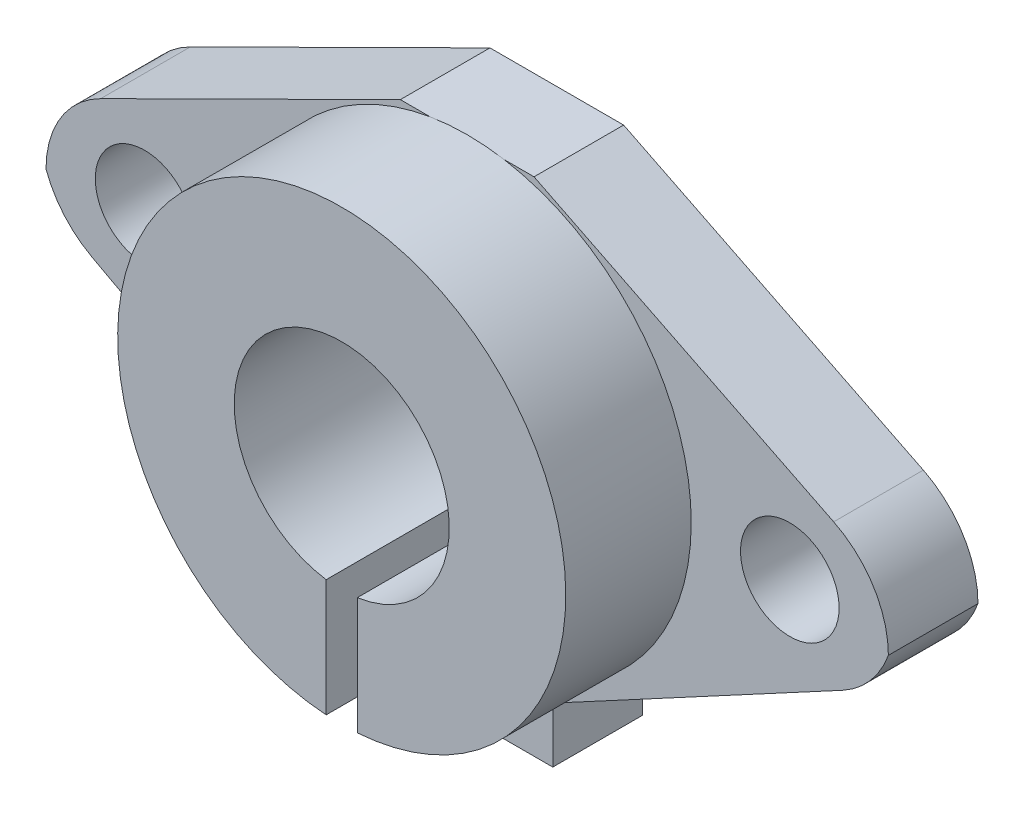
ISO-10303-21;
HEADER;
FILE_DESCRIPTION(('STEP AP214'),'2;1');
FILE_NAME('part.step','',(''),(''),'','','');
FILE_SCHEMA(('AUTOMOTIVE_DESIGN { 1 0 10303 214 1 1 1 1 }'));
ENDSEC;
DATA;
#1=APPLICATION_CONTEXT('core data for automotive mechanical design processes');
#2=APPLICATION_PROTOCOL_DEFINITION('international standard','automotive_design',2000,#1);
#3=PRODUCT_CONTEXT('',#1,'mechanical');
#4=PRODUCT('Part','Part','',(#3));
#5=PRODUCT_RELATED_PRODUCT_CATEGORY('part','',(#4));
#6=PRODUCT_DEFINITION_FORMATION('','',#4);
#7=PRODUCT_DEFINITION_CONTEXT('part definition',#1,'design');
#8=PRODUCT_DEFINITION('design','',#6,#7);
#9=PRODUCT_DEFINITION_SHAPE('','',#8);
#10=(LENGTH_UNIT() NAMED_UNIT(*) SI_UNIT(.MILLI.,.METRE.));
#11=(NAMED_UNIT(*) PLANE_ANGLE_UNIT() SI_UNIT($,.RADIAN.));
#12=(NAMED_UNIT(*) SI_UNIT($,.STERADIAN.) SOLID_ANGLE_UNIT());
#13=UNCERTAINTY_MEASURE_WITH_UNIT(LENGTH_MEASURE(1.E-05),#10,'distance_accuracy_value','');
#14=(GEOMETRIC_REPRESENTATION_CONTEXT(3) GLOBAL_UNCERTAINTY_ASSIGNED_CONTEXT((#13)) GLOBAL_UNIT_ASSIGNED_CONTEXT((#10,
#11,#12)) REPRESENTATION_CONTEXT('',''));
#15=CARTESIAN_POINT('',(0.,0.,0.));
#16=DIRECTION('',(0.,0.,1.));
#17=DIRECTION('',(1.,0.,0.));
#18=AXIS2_PLACEMENT_3D('',#15,#16,#17);
#19=CARTESIAN_POINT('',(0.,0.,5.));
#20=DIRECTION('',(0.,0.,1.));
#21=DIRECTION('',(1.,0.,0.));
#22=AXIS2_PLACEMENT_3D('',#19,#20,#21);
#23=PLANE('',#22);
#24=CARTESIAN_POINT('',(-18.,0.,5.));
#25=DIRECTION('',(0.,0.,1.));
#26=DIRECTION('',(1.,0.,0.));
#27=AXIS2_PLACEMENT_3D('',#24,#25,#26);
#28=CIRCLE('',#27,2.75);
#29=CARTESIAN_POINT('',(-15.25,0.,5.));
#30=VERTEX_POINT('',#29);
#31=EDGE_CURVE('E377',#30,#30,#28,.T.);
#32=ORIENTED_EDGE('',*,*,#31,.F.);
#33=EDGE_LOOP('',(#32));
#34=FACE_BOUND('',#33,.T.);
#35=CARTESIAN_POINT('',(-18.,-0.907891049391296,5.));
#36=DIRECTION('',(0.,0.,1.));
#37=DIRECTION('',(1.,0.,0.));
#38=AXIS2_PLACEMENT_3D('',#35,#36,#37);
#39=CIRCLE('',#38,5.5);
#40=CARTESIAN_POINT('',(-20.4484094780944,4.01707504466231,5.));
#41=VERTEX_POINT('',#40);
#42=CARTESIAN_POINT('',(-23.5,-0.907891049391296,5.));
#43=VERTEX_POINT('',#42);
#44=EDGE_CURVE('E281',#41,#43,#39,.T.);
#45=ORIENTED_EDGE('',*,*,#44,.T.);
#46=CARTESIAN_POINT('',(-18.3276639936402,0.96211970921791,5.));
#47=DIRECTION('',(0.,0.,1.));
#48=DIRECTION('',(1.,0.,0.));
#49=AXIS2_PLACEMENT_3D('',#46,#47,#48);
#50=CIRCLE('',#49,5.5);
#51=CARTESIAN_POINT('',(-20.9343819383381,-3.88091875406011,5.));
#52=VERTEX_POINT('',#51);
#53=EDGE_CURVE('E288',#43,#52,#50,.T.);
#54=ORIENTED_EDGE('',*,*,#53,.T.);
#55=DIRECTION('',(0.880552447868731,-0.473948717217787,0.));
#56=VECTOR('',#55,1.);
#57=CARTESIAN_POINT('',(-23.5,-2.5,5.));
#58=LINE('',#57,#56);
#59=CARTESIAN_POINT('',(-4.77576716215987,-12.5781346481527,5.));
#60=VERTEX_POINT('',#59);
#61=EDGE_CURVE('E216',#52,#60,#58,.T.);
#62=ORIENTED_EDGE('',*,*,#61,.T.);
#63=DIRECTION('',(0.,-1.,0.));
#64=VECTOR('',#63,1.);
#65=CARTESIAN_POINT('',(-4.77576716215987,-12.5781346481527,5.));
#66=LINE('',#65,#64);
#67=CARTESIAN_POINT('',(-4.77576716215987,-15.6709566880416,5.));
#68=VERTEX_POINT('',#67);
#69=EDGE_CURVE('E218',#60,#68,#66,.T.);
#70=ORIENTED_EDGE('',*,*,#69,.T.);
#71=DIRECTION('',(1.,0.,0.));
#72=VECTOR('',#71,1.);
#73=CARTESIAN_POINT('',(-4.77576716215987,-15.6709566880416,5.));
#74=LINE('',#73,#72);
#75=CARTESIAN_POINT('',(-0.868489511999576,-15.6709566880416,5.));
#76=VERTEX_POINT('',#75);
#77=EDGE_CURVE('E220',#68,#76,#74,.T.);
#78=ORIENTED_EDGE('',*,*,#77,.T.);
#79=DIRECTION('',(0.,1.,0.));
#80=VECTOR('',#79,1.);
#81=CARTESIAN_POINT('',(-0.868489511999576,-15.6709566880416,5.));
#82=LINE('',#81,#80);
#83=CARTESIAN_POINT('',(-0.868489511999576,-12.469792539074,5.));
#84=VERTEX_POINT('',#83);
#85=EDGE_CURVE('E222',#76,#84,#82,.T.);
#86=ORIENTED_EDGE('',*,*,#85,.T.);
#87=CARTESIAN_POINT('',(0.,0.,5.));
#88=DIRECTION('',(0.,0.,1.));
#89=DIRECTION('',(1.,0.,0.));
#90=AXIS2_PLACEMENT_3D('',#87,#88,#89);
#91=CIRCLE('',#90,12.5);
#92=CARTESIAN_POINT('',(-2.06026479168432,12.3290433119584,5.));
#93=VERTEX_POINT('',#92);
#94=EDGE_CURVE('E199',#93,#84,#91,.T.);
#95=ORIENTED_EDGE('',*,*,#94,.F.);
#96=DIRECTION('',(-1.,0.,0.));
#97=VECTOR('',#96,1.);
#98=CARTESIAN_POINT('',(-3.72891780093276,12.3290433119584,5.));
#99=LINE('',#98,#97);
#100=CARTESIAN_POINT('',(-3.72891780093276,12.3290433119584,5.));
#101=VERTEX_POINT('',#100);
#102=EDGE_CURVE('E209',#93,#101,#99,.T.);
#103=ORIENTED_EDGE('',*,*,#102,.T.);
#104=DIRECTION('',(-0.895448380737018,-0.445165359653524,0.));
#105=VECTOR('',#104,1.);
#106=CARTESIAN_POINT('',(-3.72891780093276,12.3290433119584,5.));
#107=LINE('',#106,#105);
#108=EDGE_CURVE('E212',#101,#41,#107,.T.);
#109=ORIENTED_EDGE('',*,*,#108,.T.);
#110=EDGE_LOOP('',(#45,#54,#62,#70,#78,#86,#95,#103,#109));
#111=FACE_BOUND('',#110,.T.);
#112=ADVANCED_FACE('F36',(#34,#111),#23,.T.);
#113=CARTESIAN_POINT('',(23.5,-2.5,5.));
#114=DIRECTION('',(-0.473948717217787,0.880552447868731,0.));
#115=DIRECTION('',(-0.880552447868731,-0.473948717217787,0.));
#116=AXIS2_PLACEMENT_3D('',#113,#114,#115);
#117=PLANE('',#116);
#118=DIRECTION('',(0.880552447868731,0.473948717217787,0.));
#119=VECTOR('',#118,1.);
#120=CARTESIAN_POINT('',(23.5,-2.5,0.));
#121=LINE('',#120,#119);
#122=CARTESIAN_POINT('',(4.77576716215987,-12.5781346481527,0.));
#123=VERTEX_POINT('',#122);
#124=CARTESIAN_POINT('',(20.9343819383381,-3.88091875406011,0.));
#125=VERTEX_POINT('',#124);
#126=EDGE_CURVE('E191',#123,#125,#121,.T.);
#127=ORIENTED_EDGE('',*,*,#126,.T.);
#128=DIRECTION('',(0.,0.,-1.));
#129=VECTOR('',#128,1.);
#130=CARTESIAN_POINT('',(20.9343819383381,-3.88091875406011,5.));
#131=LINE('',#130,#129);
#132=CARTESIAN_POINT('',(20.9343819383381,-3.88091875406011,5.));
#133=VERTEX_POINT('',#132);
#134=EDGE_CURVE('E44',#125,#133,#131,.F.);
#135=ORIENTED_EDGE('',*,*,#134,.T.);
#136=DIRECTION('',(0.880552447868731,0.473948717217787,0.));
#137=VECTOR('',#136,1.);
#138=CARTESIAN_POINT('',(23.5,-2.5,5.));
#139=LINE('',#138,#137);
#140=CARTESIAN_POINT('',(4.77576716215987,-12.5781346481527,5.));
#141=VERTEX_POINT('',#140);
#142=EDGE_CURVE('E204',#141,#133,#139,.T.);
#143=ORIENTED_EDGE('',*,*,#142,.F.);
#144=DIRECTION('',(0.,0.,-1.));
#145=VECTOR('',#144,1.);
#146=CARTESIAN_POINT('',(4.77576716215987,-12.5781346481527,5.));
#147=LINE('',#146,#145);
#148=EDGE_CURVE('E229',#141,#123,#147,.T.);
#149=ORIENTED_EDGE('',*,*,#148,.T.);
#150=EDGE_LOOP('',(#127,#135,#143,#149));
#151=FACE_BOUND('',#150,.T.);
#152=ADVANCED_FACE('F309',(#151),#117,.F.);
#153=CARTESIAN_POINT('',(3.72891780093276,12.3290433119584,5.));
#154=DIRECTION('',(-0.445165359653524,-0.895448380737018,0.));
#155=DIRECTION('',(0.895448380737018,-0.445165359653524,0.));
#156=AXIS2_PLACEMENT_3D('',#153,#154,#155);
#157=PLANE('',#156);
#158=DIRECTION('',(-0.895448380737018,0.445165359653524,0.));
#159=VECTOR('',#158,1.);
#160=CARTESIAN_POINT('',(3.72891780093276,12.3290433119584,5.));
#161=LINE('',#160,#159);
#162=CARTESIAN_POINT('',(20.4484094780944,4.01707504466231,5.));
#163=VERTEX_POINT('',#162);
#164=CARTESIAN_POINT('',(3.72891780093276,12.3290433119584,5.));
#165=VERTEX_POINT('',#164);
#166=EDGE_CURVE('E206',#163,#165,#161,.T.);
#167=ORIENTED_EDGE('',*,*,#166,.F.);
#168=DIRECTION('',(0.,0.,-1.));
#169=VECTOR('',#168,1.);
#170=CARTESIAN_POINT('',(20.4484094780944,4.01707504466231,5.));
#171=LINE('',#170,#169);
#172=CARTESIAN_POINT('',(20.4484094780944,4.01707504466231,0.));
#173=VERTEX_POINT('',#172);
#174=EDGE_CURVE('E290',#163,#173,#171,.T.);
#175=ORIENTED_EDGE('',*,*,#174,.T.);
#176=DIRECTION('',(-0.895448380737018,0.445165359653524,0.));
#177=VECTOR('',#176,1.);
#178=CARTESIAN_POINT('',(3.72891780093276,12.3290433119584,0.));
#179=LINE('',#178,#177);
#180=CARTESIAN_POINT('',(3.72891780093276,12.3290433119584,0.));
#181=VERTEX_POINT('',#180);
#182=EDGE_CURVE('E194',#173,#181,#179,.T.);
#183=ORIENTED_EDGE('',*,*,#182,.T.);
#184=DIRECTION('',(0.,0.,-1.));
#185=VECTOR('',#184,1.);
#186=CARTESIAN_POINT('',(3.72891780093276,12.3290433119584,5.));
#187=LINE('',#186,#185);
#188=EDGE_CURVE('E271',#165,#181,#187,.T.);
#189=ORIENTED_EDGE('',*,*,#188,.F.);
#190=EDGE_LOOP('',(#167,#175,#183,#189));
#191=FACE_BOUND('',#190,.T.);
#192=ADVANCED_FACE('F320',(#191),#157,.F.);
#193=CARTESIAN_POINT('',(-3.72891780093276,12.3290433119584,5.));
#194=DIRECTION('',(0.,-1.,0.));
#195=DIRECTION('',(0.,0.,-1.));
#196=AXIS2_PLACEMENT_3D('',#193,#194,#195);
#197=PLANE('',#196);
#198=DIRECTION('',(-1.,0.,0.));
#199=VECTOR('',#198,1.);
#200=CARTESIAN_POINT('',(-3.72891780093276,12.3290433119584,0.));
#201=LINE('',#200,#199);
#202=CARTESIAN_POINT('',(-3.72891780093276,12.3290433119584,0.));
#203=VERTEX_POINT('',#202);
#204=EDGE_CURVE('E232',#181,#203,#201,.T.);
#205=ORIENTED_EDGE('',*,*,#204,.T.);
#206=DIRECTION('',(0.,0.,-1.));
#207=VECTOR('',#206,1.);
#208=CARTESIAN_POINT('',(-3.72891780093276,12.3290433119584,5.));
#209=LINE('',#208,#207);
#210=EDGE_CURVE('E268',#101,#203,#209,.T.);
#211=ORIENTED_EDGE('',*,*,#210,.F.);
#212=ORIENTED_EDGE('',*,*,#102,.F.);
#213=CARTESIAN_POINT('',(2.06026479168432,12.3290433119584,5.));
#214=VERTEX_POINT('',#213);
#215=EDGE_CURVE('E213',#214,#93,#99,.T.);
#216=ORIENTED_EDGE('',*,*,#215,.F.);
#217=EDGE_CURVE('E210',#165,#214,#99,.T.);
#218=ORIENTED_EDGE('',*,*,#217,.F.);
#219=ORIENTED_EDGE('',*,*,#188,.T.);
#220=EDGE_LOOP('',(#205,#211,#212,#216,#218,#219));
#221=FACE_BOUND('',#220,.T.);
#222=ADVANCED_FACE('F326',(#221),#197,.F.);
#223=CARTESIAN_POINT('',(-3.72891780093276,12.3290433119584,5.));
#224=DIRECTION('',(0.445165359653524,-0.895448380737018,0.));
#225=DIRECTION('',(0.895448380737018,0.445165359653524,0.));
#226=AXIS2_PLACEMENT_3D('',#223,#224,#225);
#227=PLANE('',#226);
#228=DIRECTION('',(-0.895448380737018,-0.445165359653524,0.));
#229=VECTOR('',#228,1.);
#230=CARTESIAN_POINT('',(-3.72891780093276,12.3290433119584,0.));
#231=LINE('',#230,#229);
#232=CARTESIAN_POINT('',(-20.4484094780944,4.01707504466231,0.));
#233=VERTEX_POINT('',#232);
#234=EDGE_CURVE('E234',#203,#233,#231,.T.);
#235=ORIENTED_EDGE('',*,*,#234,.T.);
#236=DIRECTION('',(0.,0.,-1.));
#237=VECTOR('',#236,1.);
#238=CARTESIAN_POINT('',(-20.4484094780944,4.01707504466231,5.));
#239=LINE('',#238,#237);
#240=EDGE_CURVE('E279',#233,#41,#239,.F.);
#241=ORIENTED_EDGE('',*,*,#240,.T.);
#242=ORIENTED_EDGE('',*,*,#108,.F.);
#243=ORIENTED_EDGE('',*,*,#210,.T.);
#244=EDGE_LOOP('',(#235,#241,#242,#243));
#245=FACE_BOUND('',#244,.T.);
#246=ADVANCED_FACE('F331',(#245),#227,.F.);
#247=CARTESIAN_POINT('',(-23.5,-2.5,5.));
#248=DIRECTION('',(0.473948717217787,0.880552447868731,0.));
#249=DIRECTION('',(-0.880552447868731,0.473948717217787,0.));
#250=AXIS2_PLACEMENT_3D('',#247,#248,#249);
#251=PLANE('',#250);
#252=ORIENTED_EDGE('',*,*,#61,.F.);
#253=DIRECTION('',(0.,0.,-1.));
#254=VECTOR('',#253,1.);
#255=CARTESIAN_POINT('',(-20.9343819383381,-3.88091875406011,5.));
#256=LINE('',#255,#254);
#257=CARTESIAN_POINT('',(-20.9343819383381,-3.88091875406011,0.));
#258=VERTEX_POINT('',#257);
#259=EDGE_CURVE('E283',#52,#258,#256,.T.);
#260=ORIENTED_EDGE('',*,*,#259,.T.);
#261=DIRECTION('',(0.880552447868731,-0.473948717217787,0.));
#262=VECTOR('',#261,1.);
#263=CARTESIAN_POINT('',(-23.5,-2.5,0.));
#264=LINE('',#263,#262);
#265=CARTESIAN_POINT('',(-4.77576716215987,-12.5781346481527,0.));
#266=VERTEX_POINT('',#265);
#267=EDGE_CURVE('E237',#258,#266,#264,.T.);
#268=ORIENTED_EDGE('',*,*,#267,.T.);
#269=DIRECTION('',(0.,0.,-1.));
#270=VECTOR('',#269,1.);
#271=CARTESIAN_POINT('',(-4.77576716215987,-12.5781346481527,5.));
#272=LINE('',#271,#270);
#273=EDGE_CURVE('E265',#60,#266,#272,.T.);
#274=ORIENTED_EDGE('',*,*,#273,.F.);
#275=EDGE_LOOP('',(#252,#260,#268,#274));
#276=FACE_BOUND('',#275,.T.);
#277=ADVANCED_FACE('F346',(#276),#251,.F.);
#278=CARTESIAN_POINT('',(-4.77576716215987,-12.5781346481527,5.));
#279=DIRECTION('',(1.,0.,0.));
#280=DIRECTION('',(0.,0.,-1.));
#281=AXIS2_PLACEMENT_3D('',#278,#279,#280);
#282=PLANE('',#281);
#283=DIRECTION('',(0.,-1.,0.));
#284=VECTOR('',#283,1.);
#285=CARTESIAN_POINT('',(-4.77576716215987,-12.5781346481527,0.));
#286=LINE('',#285,#284);
#287=CARTESIAN_POINT('',(-4.77576716215987,-15.6709566880416,0.));
#288=VERTEX_POINT('',#287);
#289=EDGE_CURVE('E239',#266,#288,#286,.T.);
#290=ORIENTED_EDGE('',*,*,#289,.T.);
#291=DIRECTION('',(0.,0.,-1.));
#292=VECTOR('',#291,1.);
#293=CARTESIAN_POINT('',(-4.77576716215987,-15.6709566880416,5.));
#294=LINE('',#293,#292);
#295=EDGE_CURVE('E262',#68,#288,#294,.T.);
#296=ORIENTED_EDGE('',*,*,#295,.F.);
#297=ORIENTED_EDGE('',*,*,#69,.F.);
#298=ORIENTED_EDGE('',*,*,#273,.T.);
#299=EDGE_LOOP('',(#290,#296,#297,#298));
#300=FACE_BOUND('',#299,.T.);
#301=ADVANCED_FACE('F352',(#300),#282,.F.);
#302=CARTESIAN_POINT('',(-4.77576716215987,-15.6709566880416,5.));
#303=DIRECTION('',(0.,1.,0.));
#304=DIRECTION('',(0.,0.,1.));
#305=AXIS2_PLACEMENT_3D('',#302,#303,#304);
#306=PLANE('',#305);
#307=DIRECTION('',(1.,0.,0.));
#308=VECTOR('',#307,1.);
#309=CARTESIAN_POINT('',(-4.77576716215987,-15.6709566880416,0.));
#310=LINE('',#309,#308);
#311=CARTESIAN_POINT('',(-0.868489511999576,-15.6709566880416,0.));
#312=VERTEX_POINT('',#311);
#313=EDGE_CURVE('E241',#288,#312,#310,.T.);
#314=ORIENTED_EDGE('',*,*,#313,.T.);
#315=DIRECTION('',(0.,0.,-1.));
#316=VECTOR('',#315,1.);
#317=CARTESIAN_POINT('',(-0.868489511999576,-15.6709566880416,5.));
#318=LINE('',#317,#316);
#319=EDGE_CURVE('E259',#76,#312,#318,.T.);
#320=ORIENTED_EDGE('',*,*,#319,.F.);
#321=ORIENTED_EDGE('',*,*,#77,.F.);
#322=ORIENTED_EDGE('',*,*,#295,.T.);
#323=EDGE_LOOP('',(#314,#320,#321,#322));
#324=FACE_BOUND('',#323,.T.);
#325=ADVANCED_FACE('F357',(#324),#306,.F.);
#326=CARTESIAN_POINT('',(-0.868489511999576,-15.6709566880416,5.));
#327=DIRECTION('',(-1.,0.,0.));
#328=DIRECTION('',(0.,0.,1.));
#329=AXIS2_PLACEMENT_3D('',#326,#327,#328);
#330=PLANE('',#329);
#331=DIRECTION('',(0.,1.,0.));
#332=VECTOR('',#331,1.);
#333=CARTESIAN_POINT('',(-0.868489511999576,-15.6709566880416,0.));
#334=LINE('',#333,#332);
#335=CARTESIAN_POINT('',(-0.868489511999576,-5.93681109414362,0.));
#336=VERTEX_POINT('',#335);
#337=EDGE_CURVE('E243',#312,#336,#334,.T.);
#338=ORIENTED_EDGE('',*,*,#337,.T.);
#339=DIRECTION('',(0.,0.,1.));
#340=VECTOR('',#339,1.);
#341=CARTESIAN_POINT('',(-0.868489511999576,-5.93681109414362,0.));
#342=LINE('',#341,#340);
#343=CARTESIAN_POINT('',(-0.868489511999576,-5.93681109414362,12.));
#344=VERTEX_POINT('',#343);
#345=EDGE_CURVE('E376',#336,#344,#342,.T.);
#346=ORIENTED_EDGE('',*,*,#345,.T.);
#347=DIRECTION('',(0.,-1.,0.));
#348=VECTOR('',#347,1.);
#349=CARTESIAN_POINT('',(-0.868489511999576,0.,12.));
#350=LINE('',#349,#348);
#351=CARTESIAN_POINT('',(-0.868489511999576,-12.469792539074,12.));
#352=VERTEX_POINT('',#351);
#353=EDGE_CURVE('E178',#344,#352,#350,.T.);
#354=ORIENTED_EDGE('',*,*,#353,.T.);
#355=DIRECTION('',(0.,0.,-1.));
#356=VECTOR('',#355,1.);
#357=CARTESIAN_POINT('',(-0.868489511999576,-12.469792539074,12.));
#358=LINE('',#357,#356);
#359=EDGE_CURVE('E190',#84,#352,#358,.F.);
#360=ORIENTED_EDGE('',*,*,#359,.F.);
#361=ORIENTED_EDGE('',*,*,#85,.F.);
#362=ORIENTED_EDGE('',*,*,#319,.T.);
#363=EDGE_LOOP('',(#338,#346,#354,#360,#361,#362));
#364=FACE_BOUND('',#363,.T.);
#365=ADVANCED_FACE('F361',(#364),#330,.F.);
#366=CARTESIAN_POINT('',(0.868489511999576,-15.6709566880416,5.));
#367=DIRECTION('',(1.,0.,0.));
#368=DIRECTION('',(0.,0.,-1.));
#369=AXIS2_PLACEMENT_3D('',#366,#367,#368);
#370=PLANE('',#369);
#371=DIRECTION('',(0.,-1.,0.));
#372=VECTOR('',#371,1.);
#373=CARTESIAN_POINT('',(0.868489511999576,-15.6709566880416,5.));
#374=LINE('',#373,#372);
#375=CARTESIAN_POINT('',(0.868489511999576,-12.469792539074,5.));
#376=VERTEX_POINT('',#375);
#377=CARTESIAN_POINT('',(0.868489511999576,-15.6709566880416,5.));
#378=VERTEX_POINT('',#377);
#379=EDGE_CURVE('E173',#376,#378,#374,.T.);
#380=ORIENTED_EDGE('',*,*,#379,.F.);
#381=DIRECTION('',(0.,0.,-1.));
#382=VECTOR('',#381,1.);
#383=CARTESIAN_POINT('',(0.868489511999576,-12.469792539074,12.));
#384=LINE('',#383,#382);
#385=CARTESIAN_POINT('',(0.868489511999576,-12.469792539074,12.));
#386=VERTEX_POINT('',#385);
#387=EDGE_CURVE('E167',#386,#376,#384,.T.);
#388=ORIENTED_EDGE('',*,*,#387,.F.);
#389=DIRECTION('',(0.,1.,0.));
#390=VECTOR('',#389,1.);
#391=CARTESIAN_POINT('',(0.868489511999576,0.,12.));
#392=LINE('',#391,#390);
#393=CARTESIAN_POINT('',(0.868489511999576,-5.93681109414362,12.));
#394=VERTEX_POINT('',#393);
#395=EDGE_CURVE('E170',#386,#394,#392,.T.);
#396=ORIENTED_EDGE('',*,*,#395,.T.);
#397=DIRECTION('',(0.,0.,1.));
#398=VECTOR('',#397,1.);
#399=CARTESIAN_POINT('',(0.868489511999576,-5.93681109414362,0.));
#400=LINE('',#399,#398);
#401=CARTESIAN_POINT('',(0.868489511999576,-5.93681109414362,0.));
#402=VERTEX_POINT('',#401);
#403=EDGE_CURVE('E51',#394,#402,#400,.F.);
#404=ORIENTED_EDGE('',*,*,#403,.T.);
#405=DIRECTION('',(0.,-1.,0.));
#406=VECTOR('',#405,1.);
#407=CARTESIAN_POINT('',(0.868489511999576,-15.6709566880416,0.));
#408=LINE('',#407,#406);
#409=CARTESIAN_POINT('',(0.868489511999576,-15.6709566880416,0.));
#410=VERTEX_POINT('',#409);
#411=EDGE_CURVE('E246',#402,#410,#408,.T.);
#412=ORIENTED_EDGE('',*,*,#411,.T.);
#413=DIRECTION('',(0.,0.,-1.));
#414=VECTOR('',#413,1.);
#415=CARTESIAN_POINT('',(0.868489511999576,-15.6709566880416,5.));
#416=LINE('',#415,#414);
#417=EDGE_CURVE('E256',#378,#410,#416,.T.);
#418=ORIENTED_EDGE('',*,*,#417,.F.);
#419=EDGE_LOOP('',(#380,#388,#396,#404,#412,#418));
#420=FACE_BOUND('',#419,.T.);
#421=ADVANCED_FACE('F169',(#420),#370,.F.);
#422=CARTESIAN_POINT('',(0.868489511999576,-15.6709566880416,5.));
#423=DIRECTION('',(0.,1.,0.));
#424=DIRECTION('',(0.,0.,1.));
#425=AXIS2_PLACEMENT_3D('',#422,#423,#424);
#426=PLANE('',#425);
#427=DIRECTION('',(1.,0.,0.));
#428=VECTOR('',#427,1.);
#429=CARTESIAN_POINT('',(0.868489511999576,-15.6709566880416,0.));
#430=LINE('',#429,#428);
#431=CARTESIAN_POINT('',(4.77576716215987,-15.6709566880416,0.));
#432=VERTEX_POINT('',#431);
#433=EDGE_CURVE('E248',#410,#432,#430,.T.);
#434=ORIENTED_EDGE('',*,*,#433,.T.);
#435=DIRECTION('',(0.,0.,-1.));
#436=VECTOR('',#435,1.);
#437=CARTESIAN_POINT('',(4.77576716215987,-15.6709566880416,5.));
#438=LINE('',#437,#436);
#439=CARTESIAN_POINT('',(4.77576716215987,-15.6709566880416,5.));
#440=VERTEX_POINT('',#439);
#441=EDGE_CURVE('E253',#440,#432,#438,.T.);
#442=ORIENTED_EDGE('',*,*,#441,.F.);
#443=DIRECTION('',(1.,0.,0.));
#444=VECTOR('',#443,1.);
#445=CARTESIAN_POINT('',(0.868489511999576,-15.6709566880416,5.));
#446=LINE('',#445,#444);
#447=EDGE_CURVE('E226',#378,#440,#446,.T.);
#448=ORIENTED_EDGE('',*,*,#447,.F.);
#449=ORIENTED_EDGE('',*,*,#417,.T.);
#450=EDGE_LOOP('',(#434,#442,#448,#449));
#451=FACE_BOUND('',#450,.T.);
#452=ADVANCED_FACE('F397',(#451),#426,.F.);
#453=CARTESIAN_POINT('',(4.77576716215987,-12.5781346481527,5.));
#454=DIRECTION('',(-1.,0.,0.));
#455=DIRECTION('',(0.,0.,1.));
#456=AXIS2_PLACEMENT_3D('',#453,#454,#455);
#457=PLANE('',#456);
#458=DIRECTION('',(0.,1.,0.));
#459=VECTOR('',#458,1.);
#460=CARTESIAN_POINT('',(4.77576716215987,-12.5781346481527,0.));
#461=LINE('',#460,#459);
#462=EDGE_CURVE('E207',#432,#123,#461,.T.);
#463=ORIENTED_EDGE('',*,*,#462,.T.);
#464=ORIENTED_EDGE('',*,*,#148,.F.);
#465=DIRECTION('',(0.,1.,0.));
#466=VECTOR('',#465,1.);
#467=CARTESIAN_POINT('',(4.77576716215987,-12.5781346481527,5.));
#468=LINE('',#467,#466);
#469=EDGE_CURVE('E228',#440,#141,#468,.T.);
#470=ORIENTED_EDGE('',*,*,#469,.F.);
#471=ORIENTED_EDGE('',*,*,#441,.T.);
#472=EDGE_LOOP('',(#463,#464,#470,#471));
#473=FACE_BOUND('',#472,.T.);
#474=ADVANCED_FACE('F388',(#473),#457,.F.);
#475=CARTESIAN_POINT('',(18.,0.,5.));
#476=DIRECTION('',(0.,0.,1.));
#477=DIRECTION('',(1.,0.,0.));
#478=AXIS2_PLACEMENT_3D('',#475,#476,#477);
#479=CIRCLE('',#478,2.75);
#480=CARTESIAN_POINT('',(20.75,0.,5.));
#481=VERTEX_POINT('',#480);
#482=EDGE_CURVE('E197',#481,#481,#479,.T.);
#483=ORIENTED_EDGE('',*,*,#482,.F.);
#484=EDGE_LOOP('',(#483));
#485=FACE_BOUND('',#484,.T.);
#486=ORIENTED_EDGE('',*,*,#142,.T.);
#487=CARTESIAN_POINT('',(18.3276639936402,0.96211970921791,5.));
#488=DIRECTION('',(0.,0.,1.));
#489=DIRECTION('',(1.,0.,0.));
#490=AXIS2_PLACEMENT_3D('',#487,#488,#489);
#491=CIRCLE('',#490,5.5);
#492=CARTESIAN_POINT('',(23.5,-0.907891049391296,5.));
#493=VERTEX_POINT('',#492);
#494=EDGE_CURVE('E11',#133,#493,#491,.T.);
#495=ORIENTED_EDGE('',*,*,#494,.T.);
#496=CARTESIAN_POINT('',(18.,-0.907891049391296,5.));
#497=DIRECTION('',(0.,0.,1.));
#498=DIRECTION('',(1.,0.,0.));
#499=AXIS2_PLACEMENT_3D('',#496,#497,#498);
#500=CIRCLE('',#499,5.5);
#501=EDGE_CURVE('E299',#493,#163,#500,.T.);
#502=ORIENTED_EDGE('',*,*,#501,.T.);
#503=ORIENTED_EDGE('',*,*,#166,.T.);
#504=ORIENTED_EDGE('',*,*,#217,.T.);
#505=EDGE_CURVE('E200',#376,#214,#91,.T.);
#506=ORIENTED_EDGE('',*,*,#505,.F.);
#507=ORIENTED_EDGE('',*,*,#379,.T.);
#508=ORIENTED_EDGE('',*,*,#447,.T.);
#509=ORIENTED_EDGE('',*,*,#469,.T.);
#510=EDGE_LOOP('',(#486,#495,#502,#503,#504,#506,#507,#508,#509));
#511=FACE_BOUND('',#510,.T.);
#512=ADVANCED_FACE('F314',(#485,#511),#23,.T.);
#513=CARTESIAN_POINT('',(0.,0.,0.));
#514=DIRECTION('',(0.,0.,1.));
#515=DIRECTION('',(1.,0.,0.));
#516=AXIS2_PLACEMENT_3D('',#513,#514,#515);
#517=PLANE('',#516);
#518=CARTESIAN_POINT('',(18.,0.,0.));
#519=DIRECTION('',(0.,0.,1.));
#520=DIRECTION('',(-1.,0.,0.));
#521=AXIS2_PLACEMENT_3D('',#518,#519,#520);
#522=CIRCLE('',#521,2.75);
#523=CARTESIAN_POINT('',(15.25,0.,0.));
#524=VERTEX_POINT('',#523);
#525=EDGE_CURVE('E362',#524,#524,#522,.T.);
#526=ORIENTED_EDGE('',*,*,#525,.T.);
#527=EDGE_LOOP('',(#526));
#528=FACE_BOUND('',#527,.T.);
#529=CARTESIAN_POINT('',(-18.,0.,0.));
#530=DIRECTION('',(0.,0.,1.));
#531=DIRECTION('',(1.,0.,0.));
#532=AXIS2_PLACEMENT_3D('',#529,#530,#531);
#533=CIRCLE('',#532,2.75);
#534=CARTESIAN_POINT('',(-15.25,0.,0.));
#535=VERTEX_POINT('',#534);
#536=EDGE_CURVE('E365',#535,#535,#533,.T.);
#537=ORIENTED_EDGE('',*,*,#536,.T.);
#538=EDGE_LOOP('',(#537));
#539=FACE_BOUND('',#538,.T.);
#540=CARTESIAN_POINT('',(18.,-0.907891049391296,0.));
#541=DIRECTION('',(0.,0.,1.));
#542=DIRECTION('',(1.,0.,0.));
#543=AXIS2_PLACEMENT_3D('',#540,#541,#542);
#544=CIRCLE('',#543,5.5);
#545=CARTESIAN_POINT('',(23.5,-0.907891049391296,0.));
#546=VERTEX_POINT('',#545);
#547=EDGE_CURVE('E293',#173,#546,#544,.F.);
#548=ORIENTED_EDGE('',*,*,#547,.T.);
#549=CARTESIAN_POINT('',(18.3276639936402,0.96211970921791,0.));
#550=DIRECTION('',(0.,0.,1.));
#551=DIRECTION('',(1.,0.,0.));
#552=AXIS2_PLACEMENT_3D('',#549,#550,#551);
#553=CIRCLE('',#552,5.5);
#554=EDGE_CURVE('E301',#546,#125,#553,.F.);
#555=ORIENTED_EDGE('',*,*,#554,.T.);
#556=ORIENTED_EDGE('',*,*,#126,.F.);
#557=ORIENTED_EDGE('',*,*,#462,.F.);
#558=ORIENTED_EDGE('',*,*,#433,.F.);
#559=ORIENTED_EDGE('',*,*,#411,.F.);
#560=CARTESIAN_POINT('',(0.,0.,0.));
#561=DIRECTION('',(0.,0.,1.));
#562=DIRECTION('',(1.,0.,0.));
#563=AXIS2_PLACEMENT_3D('',#560,#561,#562);
#564=CIRCLE('',#563,6.);
#565=EDGE_CURVE('E372',#402,#336,#564,.T.);
#566=ORIENTED_EDGE('',*,*,#565,.T.);
#567=ORIENTED_EDGE('',*,*,#337,.F.);
#568=ORIENTED_EDGE('',*,*,#313,.F.);
#569=ORIENTED_EDGE('',*,*,#289,.F.);
#570=ORIENTED_EDGE('',*,*,#267,.F.);
#571=CARTESIAN_POINT('',(-18.3276639936402,0.96211970921791,0.));
#572=DIRECTION('',(0.,0.,1.));
#573=DIRECTION('',(1.,0.,0.));
#574=AXIS2_PLACEMENT_3D('',#571,#572,#573);
#575=CIRCLE('',#574,5.5);
#576=CARTESIAN_POINT('',(-23.5,-0.907891049391296,0.));
#577=VERTEX_POINT('',#576);
#578=EDGE_CURVE('E286',#258,#577,#575,.F.);
#579=ORIENTED_EDGE('',*,*,#578,.T.);
#580=CARTESIAN_POINT('',(-18.,-0.907891049391296,0.));
#581=DIRECTION('',(0.,0.,1.));
#582=DIRECTION('',(1.,0.,0.));
#583=AXIS2_PLACEMENT_3D('',#580,#581,#582);
#584=CIRCLE('',#583,5.5);
#585=EDGE_CURVE('E277',#577,#233,#584,.F.);
#586=ORIENTED_EDGE('',*,*,#585,.T.);
#587=ORIENTED_EDGE('',*,*,#234,.F.);
#588=ORIENTED_EDGE('',*,*,#204,.F.);
#589=ORIENTED_EDGE('',*,*,#182,.F.);
#590=EDGE_LOOP('',(#548,#555,#556,#557,#558,#559,#566,#567,#568,#569,#570,#579,#586,#587,#588,#589));
#591=FACE_BOUND('',#590,.T.);
#592=ADVANCED_FACE('F304',(#528,#539,#591),#517,.F.);
#593=CARTESIAN_POINT('',(0.,0.,5.));
#594=DIRECTION('',(0.,0.,1.));
#595=DIRECTION('',(1.,0.,0.));
#596=AXIS2_PLACEMENT_3D('',#593,#594,#595);
#597=PLANE('',#596);
#598=EDGE_CURVE('E192',#214,#93,#91,.T.);
#599=ORIENTED_EDGE('',*,*,#598,.F.);
#600=ORIENTED_EDGE('',*,*,#215,.T.);
#601=EDGE_LOOP('',(#599,#600));
#602=FACE_BOUND('',#601,.T.);
#603=ADVANCED_FACE('F394',(#602),#597,.F.);
#604=CARTESIAN_POINT('',(0.,0.,12.));
#605=DIRECTION('',(0.,0.,-1.));
#606=DIRECTION('',(-1.,0.,0.));
#607=AXIS2_PLACEMENT_3D('',#604,#605,#606);
#608=CYLINDRICAL_SURFACE('',#607,12.5);
#609=ORIENTED_EDGE('',*,*,#94,.T.);
#610=ORIENTED_EDGE('',*,*,#359,.T.);
#611=CARTESIAN_POINT('',(0.,0.,12.));
#612=DIRECTION('',(0.,0.,1.));
#613=DIRECTION('',(1.,0.,0.));
#614=AXIS2_PLACEMENT_3D('',#611,#612,#613);
#615=CIRCLE('',#614,12.5);
#616=EDGE_CURVE('E184',#386,#352,#615,.T.);
#617=ORIENTED_EDGE('',*,*,#616,.F.);
#618=ORIENTED_EDGE('',*,*,#387,.T.);
#619=ORIENTED_EDGE('',*,*,#505,.T.);
#620=ORIENTED_EDGE('',*,*,#598,.T.);
#621=EDGE_LOOP('',(#609,#610,#617,#618,#619,#620));
#622=FACE_BOUND('',#621,.T.);
#623=ADVANCED_FACE('F189',(#622),#608,.T.);
#624=CARTESIAN_POINT('',(0.,0.,12.));
#625=DIRECTION('',(0.,0.,1.));
#626=DIRECTION('',(1.,0.,0.));
#627=AXIS2_PLACEMENT_3D('',#624,#625,#626);
#628=PLANE('',#627);
#629=ORIENTED_EDGE('',*,*,#353,.F.);
#630=CARTESIAN_POINT('',(0.,0.,12.));
#631=DIRECTION('',(0.,0.,1.));
#632=DIRECTION('',(1.,0.,0.));
#633=AXIS2_PLACEMENT_3D('',#630,#631,#632);
#634=CIRCLE('',#633,6.);
#635=EDGE_CURVE('E185',#394,#344,#634,.T.);
#636=ORIENTED_EDGE('',*,*,#635,.F.);
#637=ORIENTED_EDGE('',*,*,#395,.F.);
#638=ORIENTED_EDGE('',*,*,#616,.T.);
#639=EDGE_LOOP('',(#629,#636,#637,#638));
#640=FACE_BOUND('',#639,.T.);
#641=ADVANCED_FACE('F183',(#640),#628,.T.);
#642=CARTESIAN_POINT('',(0.,0.,0.));
#643=DIRECTION('',(0.,0.,1.));
#644=DIRECTION('',(1.,0.,0.));
#645=AXIS2_PLACEMENT_3D('',#642,#643,#644);
#646=CYLINDRICAL_SURFACE('',#645,6.);
#647=ORIENTED_EDGE('',*,*,#635,.T.);
#648=ORIENTED_EDGE('',*,*,#345,.F.);
#649=ORIENTED_EDGE('',*,*,#565,.F.);
#650=ORIENTED_EDGE('',*,*,#403,.F.);
#651=EDGE_LOOP('',(#647,#648,#649,#650));
#652=FACE_BOUND('',#651,.T.);
#653=ADVANCED_FACE('F473',(#652),#646,.F.);
#654=CARTESIAN_POINT('',(-18.,0.,0.));
#655=DIRECTION('',(0.,0.,1.));
#656=DIRECTION('',(1.,0.,0.));
#657=AXIS2_PLACEMENT_3D('',#654,#655,#656);
#658=CYLINDRICAL_SURFACE('',#657,2.75);
#659=ORIENTED_EDGE('',*,*,#31,.T.);
#660=EDGE_LOOP('',(#659));
#661=FACE_BOUND('',#660,.T.);
#662=ORIENTED_EDGE('',*,*,#536,.F.);
#663=EDGE_LOOP('',(#662));
#664=FACE_BOUND('',#663,.T.);
#665=ADVANCED_FACE('F481',(#661,#664),#658,.F.);
#666=CARTESIAN_POINT('',(18.,0.,0.));
#667=DIRECTION('',(0.,0.,1.));
#668=DIRECTION('',(1.,0.,0.));
#669=AXIS2_PLACEMENT_3D('',#666,#667,#668);
#670=CYLINDRICAL_SURFACE('',#669,2.75);
#671=ORIENTED_EDGE('',*,*,#482,.T.);
#672=EDGE_LOOP('',(#671));
#673=FACE_BOUND('',#672,.T.);
#674=ORIENTED_EDGE('',*,*,#525,.F.);
#675=EDGE_LOOP('',(#674));
#676=FACE_BOUND('',#675,.T.);
#677=ADVANCED_FACE('F384',(#673,#676),#670,.F.);
#678=CARTESIAN_POINT('',(-18.,-0.907891049391296,5.));
#679=DIRECTION('',(0.,0.,-1.));
#680=DIRECTION('',(-1.,0.,0.));
#681=AXIS2_PLACEMENT_3D('',#678,#679,#680);
#682=CYLINDRICAL_SURFACE('',#681,5.5);
#683=ORIENTED_EDGE('',*,*,#44,.F.);
#684=ORIENTED_EDGE('',*,*,#240,.F.);
#685=ORIENTED_EDGE('',*,*,#585,.F.);
#686=DIRECTION('',(0.,0.,-1.));
#687=VECTOR('',#686,1.);
#688=CARTESIAN_POINT('',(-23.5,-0.907891049391296,5.));
#689=LINE('',#688,#687);
#690=EDGE_CURVE('E274',#43,#577,#689,.T.);
#691=ORIENTED_EDGE('',*,*,#690,.F.);
#692=EDGE_LOOP('',(#683,#684,#685,#691));
#693=FACE_BOUND('',#692,.T.);
#694=ADVANCED_FACE('F337',(#693),#682,.T.);
#695=CARTESIAN_POINT('',(-18.3276639936402,0.96211970921791,5.));
#696=DIRECTION('',(0.,0.,-1.));
#697=DIRECTION('',(-1.,0.,0.));
#698=AXIS2_PLACEMENT_3D('',#695,#696,#697);
#699=CYLINDRICAL_SURFACE('',#698,5.5);
#700=ORIENTED_EDGE('',*,*,#53,.F.);
#701=ORIENTED_EDGE('',*,*,#690,.T.);
#702=ORIENTED_EDGE('',*,*,#578,.F.);
#703=ORIENTED_EDGE('',*,*,#259,.F.);
#704=EDGE_LOOP('',(#700,#701,#702,#703));
#705=FACE_BOUND('',#704,.T.);
#706=ADVANCED_FACE('F342',(#705),#699,.T.);
#707=CARTESIAN_POINT('',(18.,-0.907891049391296,5.));
#708=DIRECTION('',(0.,0.,-1.));
#709=DIRECTION('',(-1.,0.,0.));
#710=AXIS2_PLACEMENT_3D('',#707,#708,#709);
#711=CYLINDRICAL_SURFACE('',#710,5.5);
#712=ORIENTED_EDGE('',*,*,#501,.F.);
#713=DIRECTION('',(0.,0.,-1.));
#714=VECTOR('',#713,1.);
#715=CARTESIAN_POINT('',(23.5,-0.907891049391296,5.));
#716=LINE('',#715,#714);
#717=EDGE_CURVE('E296',#546,#493,#716,.F.);
#718=ORIENTED_EDGE('',*,*,#717,.F.);
#719=ORIENTED_EDGE('',*,*,#547,.F.);
#720=ORIENTED_EDGE('',*,*,#174,.F.);
#721=EDGE_LOOP('',(#712,#718,#719,#720));
#722=FACE_BOUND('',#721,.T.);
#723=ADVANCED_FACE('F318',(#722),#711,.T.);
#724=CARTESIAN_POINT('',(18.3276639936402,0.96211970921791,5.));
#725=DIRECTION('',(0.,0.,-1.));
#726=DIRECTION('',(-1.,0.,0.));
#727=AXIS2_PLACEMENT_3D('',#724,#725,#726);
#728=CYLINDRICAL_SURFACE('',#727,5.5);
#729=ORIENTED_EDGE('',*,*,#494,.F.);
#730=ORIENTED_EDGE('',*,*,#134,.F.);
#731=ORIENTED_EDGE('',*,*,#554,.F.);
#732=ORIENTED_EDGE('',*,*,#717,.T.);
#733=EDGE_LOOP('',(#729,#730,#731,#732));
#734=FACE_BOUND('',#733,.T.);
#735=ADVANCED_FACE('F38',(#734),#728,.T.);
#736=CLOSED_SHELL('',(#112,#152,#192,#222,#246,#277,#301,#325,#365,#421,#452,#474,#512,#592,
#603,#623,#641,#653,#665,#677,#694,#706,#723,#735));
#737=MANIFOLD_SOLID_BREP('B2',#736);
#738=ADVANCED_BREP_SHAPE_REPRESENTATION('',(#18,#737),#14);
#739=SHAPE_DEFINITION_REPRESENTATION(#9,#738);
ENDSEC;
END-ISO-10303-21;
